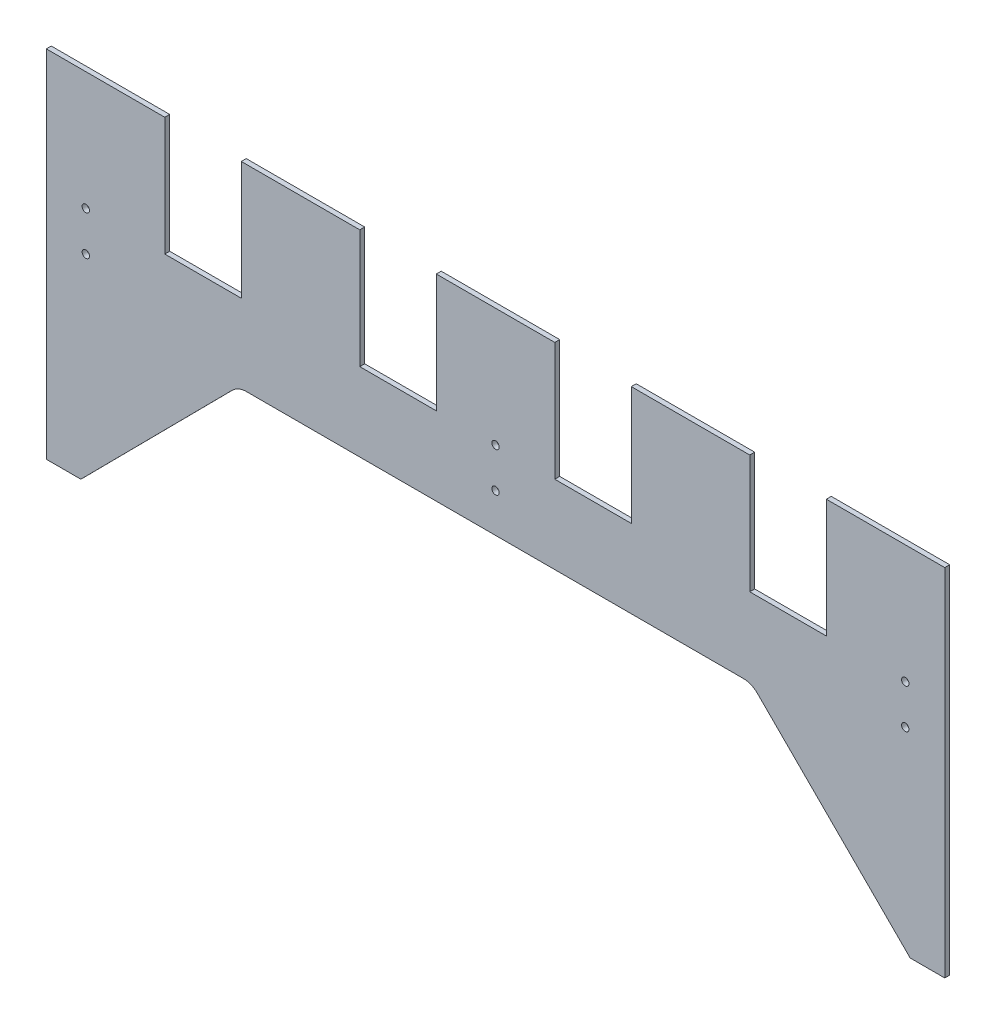
ISO-10303-21;
HEADER;
FILE_DESCRIPTION(('STEP AP214'),'2;1');
FILE_NAME('part.step','',(''),(''),'','','');
FILE_SCHEMA(('AUTOMOTIVE_DESIGN { 1 0 10303 214 1 1 1 1 }'));
ENDSEC;
DATA;
#1=APPLICATION_CONTEXT('core data for automotive mechanical design processes');
#2=APPLICATION_PROTOCOL_DEFINITION('international standard','automotive_design',2000,#1);
#3=PRODUCT_CONTEXT('',#1,'mechanical');
#4=PRODUCT('Part','Part','',(#3));
#5=PRODUCT_RELATED_PRODUCT_CATEGORY('part','',(#4));
#6=PRODUCT_DEFINITION_FORMATION('','',#4);
#7=PRODUCT_DEFINITION_CONTEXT('part definition',#1,'design');
#8=PRODUCT_DEFINITION('design','',#6,#7);
#9=PRODUCT_DEFINITION_SHAPE('','',#8);
#10=(LENGTH_UNIT() NAMED_UNIT(*) SI_UNIT(.MILLI.,.METRE.));
#11=(NAMED_UNIT(*) PLANE_ANGLE_UNIT() SI_UNIT($,.RADIAN.));
#12=(NAMED_UNIT(*) SI_UNIT($,.STERADIAN.) SOLID_ANGLE_UNIT());
#13=UNCERTAINTY_MEASURE_WITH_UNIT(LENGTH_MEASURE(1.E-05),#10,'distance_accuracy_value','');
#14=(GEOMETRIC_REPRESENTATION_CONTEXT(3) GLOBAL_UNCERTAINTY_ASSIGNED_CONTEXT((#13)) GLOBAL_UNIT_ASSIGNED_CONTEXT((#10,
#11,#12)) REPRESENTATION_CONTEXT('',''));
#15=CARTESIAN_POINT('',(0.,0.,0.));
#16=DIRECTION('',(0.,0.,1.));
#17=DIRECTION('',(1.,0.,0.));
#18=AXIS2_PLACEMENT_3D('',#15,#16,#17);
#19=CARTESIAN_POINT('',(0.,0.,0.));
#20=DIRECTION('',(0.,0.,1.));
#21=DIRECTION('',(1.,0.,0.));
#22=AXIS2_PLACEMENT_3D('',#19,#20,#21);
#23=PLANE('',#22);
#24=CARTESIAN_POINT('',(0.,25.4,0.));
#25=DIRECTION('',(0.,0.,-1.));
#26=DIRECTION('',(-1.,0.,0.));
#27=AXIS2_PLACEMENT_3D('',#24,#25,#26);
#28=CIRCLE('',#27,4.7625);
#29=CARTESIAN_POINT('',(-4.7625,25.4,0.));
#30=VERTEX_POINT('',#29);
#31=EDGE_CURVE('E212',#30,#30,#28,.F.);
#32=ORIENTED_EDGE('',*,*,#31,.T.);
#33=EDGE_LOOP('',(#32));
#34=FACE_BOUND('',#33,.T.);
#35=CARTESIAN_POINT('',(0.,76.2,0.));
#36=DIRECTION('',(0.,0.,-1.));
#37=DIRECTION('',(-1.,0.,0.));
#38=AXIS2_PLACEMENT_3D('',#35,#36,#37);
#39=CIRCLE('',#38,4.7625);
#40=CARTESIAN_POINT('',(-4.7625,76.2,0.));
#41=VERTEX_POINT('',#40);
#42=EDGE_CURVE('E551',#41,#41,#39,.F.);
#43=ORIENTED_EDGE('',*,*,#42,.T.);
#44=EDGE_LOOP('',(#43));
#45=FACE_BOUND('',#44,.T.);
#46=CARTESIAN_POINT('',(-527.05,76.2,0.));
#47=DIRECTION('',(0.,0.,1.));
#48=DIRECTION('',(1.,0.,0.));
#49=AXIS2_PLACEMENT_3D('',#46,#47,#48);
#50=CIRCLE('',#49,4.7625);
#51=CARTESIAN_POINT('',(-522.2875,76.2,0.));
#52=VERTEX_POINT('',#51);
#53=EDGE_CURVE('E554',#52,#52,#50,.T.);
#54=ORIENTED_EDGE('',*,*,#53,.T.);
#55=EDGE_LOOP('',(#54));
#56=FACE_BOUND('',#55,.T.);
#57=CARTESIAN_POINT('',(-527.05,25.4,0.));
#58=DIRECTION('',(0.,0.,1.));
#59=DIRECTION('',(1.,0.,0.));
#60=AXIS2_PLACEMENT_3D('',#57,#58,#59);
#61=CIRCLE('',#60,4.7625);
#62=CARTESIAN_POINT('',(-522.2875,25.4,0.));
#63=VERTEX_POINT('',#62);
#64=EDGE_CURVE('E557',#63,#63,#61,.T.);
#65=ORIENTED_EDGE('',*,*,#64,.T.);
#66=EDGE_LOOP('',(#65));
#67=FACE_BOUND('',#66,.T.);
#68=CARTESIAN_POINT('',(527.05,76.2,0.));
#69=DIRECTION('',(0.,0.,-1.));
#70=DIRECTION('',(-1.,0.,0.));
#71=AXIS2_PLACEMENT_3D('',#68,#69,#70);
#72=CIRCLE('',#71,4.7625);
#73=CARTESIAN_POINT('',(522.2875,76.2,0.));
#74=VERTEX_POINT('',#73);
#75=EDGE_CURVE('E560',#74,#74,#72,.F.);
#76=ORIENTED_EDGE('',*,*,#75,.T.);
#77=EDGE_LOOP('',(#76));
#78=FACE_BOUND('',#77,.T.);
#79=CARTESIAN_POINT('',(527.05,25.4,0.));
#80=DIRECTION('',(0.,0.,-1.));
#81=DIRECTION('',(-1.,0.,0.));
#82=AXIS2_PLACEMENT_3D('',#79,#80,#81);
#83=CIRCLE('',#82,4.7625);
#84=CARTESIAN_POINT('',(522.2875,25.4,0.));
#85=VERTEX_POINT('',#84);
#86=EDGE_CURVE('E463',#85,#85,#83,.F.);
#87=ORIENTED_EDGE('',*,*,#86,.T.);
#88=EDGE_LOOP('',(#87));
#89=FACE_BOUND('',#88,.T.);
#90=DIRECTION('',(-0.703965142447958,-0.710234523392257,0.));
#91=VECTOR('',#90,1.);
#92=CARTESIAN_POINT('',(-331.100819197342,-24.4991808026428,0.));
#93=LINE('',#92,#91);
#94=CARTESIAN_POINT('',(-338.553730356378,-32.0184661844913,0.));
#95=VERTEX_POINT('',#94);
#96=CARTESIAN_POINT('',(-533.399999999995,-228.600000000003,0.));
#97=VERTEX_POINT('',#96);
#98=EDGE_CURVE('E64',#95,#97,#93,.T.);
#99=ORIENTED_EDGE('',*,*,#98,.T.);
#100=DIRECTION('',(1.,0.,0.));
#101=VECTOR('',#100,1.);
#102=CARTESIAN_POINT('',(-577.85,-228.6,0.));
#103=LINE('',#102,#101);
#104=CARTESIAN_POINT('',(-577.85,-228.6,0.));
#105=VERTEX_POINT('',#104);
#106=EDGE_CURVE('E267',#105,#97,#103,.T.);
#107=ORIENTED_EDGE('',*,*,#106,.F.);
#108=DIRECTION('',(0.,1.,0.));
#109=VECTOR('',#108,1.);
#110=CARTESIAN_POINT('',(-577.85,228.6,0.));
#111=LINE('',#110,#109);
#112=CARTESIAN_POINT('',(-577.85,228.6,0.));
#113=VERTEX_POINT('',#112);
#114=EDGE_CURVE('E268',#113,#105,#111,.F.);
#115=ORIENTED_EDGE('',*,*,#114,.F.);
#116=DIRECTION('',(1.,0.,0.));
#117=VECTOR('',#116,1.);
#118=CARTESIAN_POINT('',(577.85,228.6,0.));
#119=LINE('',#118,#117);
#120=CARTESIAN_POINT('',(-425.45,228.6,0.));
#121=VERTEX_POINT('',#120);
#122=EDGE_CURVE('E289',#121,#113,#119,.F.);
#123=ORIENTED_EDGE('',*,*,#122,.F.);
#124=DIRECTION('',(0.,1.,0.));
#125=VECTOR('',#124,1.);
#126=CARTESIAN_POINT('',(-425.45,228.6,0.));
#127=LINE('',#126,#125);
#128=CARTESIAN_POINT('',(-425.45,76.2,0.));
#129=VERTEX_POINT('',#128);
#130=EDGE_CURVE('E299',#121,#129,#127,.F.);
#131=ORIENTED_EDGE('',*,*,#130,.T.);
#132=DIRECTION('',(1.,0.,0.));
#133=VECTOR('',#132,1.);
#134=CARTESIAN_POINT('',(-425.45,76.2,0.));
#135=LINE('',#134,#133);
#136=CARTESIAN_POINT('',(-327.025,76.2,0.));
#137=VERTEX_POINT('',#136);
#138=EDGE_CURVE('E309',#129,#137,#135,.T.);
#139=ORIENTED_EDGE('',*,*,#138,.T.);
#140=DIRECTION('',(0.,1.,0.));
#141=VECTOR('',#140,1.);
#142=CARTESIAN_POINT('',(-327.025,76.2,0.));
#143=LINE('',#142,#141);
#144=CARTESIAN_POINT('',(-327.025,228.6,0.));
#145=VERTEX_POINT('',#144);
#146=EDGE_CURVE('E319',#137,#145,#143,.T.);
#147=ORIENTED_EDGE('',*,*,#146,.T.);
#148=DIRECTION('',(1.,0.,0.));
#149=VECTOR('',#148,1.);
#150=CARTESIAN_POINT('',(577.85,228.6,0.));
#151=LINE('',#150,#149);
#152=CARTESIAN_POINT('',(-174.625,228.6,0.));
#153=VERTEX_POINT('',#152);
#154=EDGE_CURVE('E330',#153,#145,#151,.F.);
#155=ORIENTED_EDGE('',*,*,#154,.F.);
#156=DIRECTION('',(0.,1.,0.));
#157=VECTOR('',#156,1.);
#158=CARTESIAN_POINT('',(-174.625,228.6,0.));
#159=LINE('',#158,#157);
#160=CARTESIAN_POINT('',(-174.625,76.2,0.));
#161=VERTEX_POINT('',#160);
#162=EDGE_CURVE('E340',#153,#161,#159,.F.);
#163=ORIENTED_EDGE('',*,*,#162,.T.);
#164=DIRECTION('',(1.,0.,0.));
#165=VECTOR('',#164,1.);
#166=CARTESIAN_POINT('',(-174.625,76.2,0.));
#167=LINE('',#166,#165);
#168=CARTESIAN_POINT('',(-76.2,76.2,0.));
#169=VERTEX_POINT('',#168);
#170=EDGE_CURVE('E350',#161,#169,#167,.T.);
#171=ORIENTED_EDGE('',*,*,#170,.T.);
#172=DIRECTION('',(0.,1.,0.));
#173=VECTOR('',#172,1.);
#174=CARTESIAN_POINT('',(-76.2,76.2,0.));
#175=LINE('',#174,#173);
#176=CARTESIAN_POINT('',(-76.2,228.6,0.));
#177=VERTEX_POINT('',#176);
#178=EDGE_CURVE('E360',#169,#177,#175,.T.);
#179=ORIENTED_EDGE('',*,*,#178,.T.);
#180=DIRECTION('',(1.,0.,0.));
#181=VECTOR('',#180,1.);
#182=CARTESIAN_POINT('',(577.85,228.6,0.));
#183=LINE('',#182,#181);
#184=CARTESIAN_POINT('',(76.2,228.6,0.));
#185=VERTEX_POINT('',#184);
#186=EDGE_CURVE('E371',#185,#177,#183,.F.);
#187=ORIENTED_EDGE('',*,*,#186,.F.);
#188=DIRECTION('',(0.,1.,0.));
#189=VECTOR('',#188,1.);
#190=CARTESIAN_POINT('',(76.2,228.6,0.));
#191=LINE('',#190,#189);
#192=CARTESIAN_POINT('',(76.2,76.2,0.));
#193=VERTEX_POINT('',#192);
#194=EDGE_CURVE('E381',#185,#193,#191,.F.);
#195=ORIENTED_EDGE('',*,*,#194,.T.);
#196=DIRECTION('',(1.,0.,0.));
#197=VECTOR('',#196,1.);
#198=CARTESIAN_POINT('',(76.2,76.2,0.));
#199=LINE('',#198,#197);
#200=CARTESIAN_POINT('',(174.625,76.2,0.));
#201=VERTEX_POINT('',#200);
#202=EDGE_CURVE('E391',#193,#201,#199,.T.);
#203=ORIENTED_EDGE('',*,*,#202,.T.);
#204=DIRECTION('',(0.,1.,0.));
#205=VECTOR('',#204,1.);
#206=CARTESIAN_POINT('',(174.625,76.2,0.));
#207=LINE('',#206,#205);
#208=CARTESIAN_POINT('',(174.625,228.6,0.));
#209=VERTEX_POINT('',#208);
#210=EDGE_CURVE('E401',#201,#209,#207,.T.);
#211=ORIENTED_EDGE('',*,*,#210,.T.);
#212=DIRECTION('',(1.,0.,0.));
#213=VECTOR('',#212,1.);
#214=CARTESIAN_POINT('',(577.85,228.6,0.));
#215=LINE('',#214,#213);
#216=CARTESIAN_POINT('',(327.025,228.6,0.));
#217=VERTEX_POINT('',#216);
#218=EDGE_CURVE('E412',#217,#209,#215,.F.);
#219=ORIENTED_EDGE('',*,*,#218,.F.);
#220=DIRECTION('',(0.,1.,0.));
#221=VECTOR('',#220,1.);
#222=CARTESIAN_POINT('',(327.025,228.6,0.));
#223=LINE('',#222,#221);
#224=CARTESIAN_POINT('',(327.025,76.2,0.));
#225=VERTEX_POINT('',#224);
#226=EDGE_CURVE('E422',#217,#225,#223,.F.);
#227=ORIENTED_EDGE('',*,*,#226,.T.);
#228=DIRECTION('',(1.,0.,0.));
#229=VECTOR('',#228,1.);
#230=CARTESIAN_POINT('',(327.025,76.2,0.));
#231=LINE('',#230,#229);
#232=CARTESIAN_POINT('',(425.45,76.2,0.));
#233=VERTEX_POINT('',#232);
#234=EDGE_CURVE('E432',#225,#233,#231,.T.);
#235=ORIENTED_EDGE('',*,*,#234,.T.);
#236=DIRECTION('',(0.,1.,0.));
#237=VECTOR('',#236,1.);
#238=CARTESIAN_POINT('',(425.45,76.2,0.));
#239=LINE('',#238,#237);
#240=CARTESIAN_POINT('',(425.45,228.6,0.));
#241=VERTEX_POINT('',#240);
#242=EDGE_CURVE('E442',#233,#241,#239,.T.);
#243=ORIENTED_EDGE('',*,*,#242,.T.);
#244=DIRECTION('',(1.,0.,0.));
#245=VECTOR('',#244,1.);
#246=CARTESIAN_POINT('',(577.85,228.6,0.));
#247=LINE('',#246,#245);
#248=CARTESIAN_POINT('',(577.85,228.6,0.));
#249=VERTEX_POINT('',#248);
#250=EDGE_CURVE('E452',#249,#241,#247,.F.);
#251=ORIENTED_EDGE('',*,*,#250,.F.);
#252=DIRECTION('',(0.,1.,0.));
#253=VECTOR('',#252,1.);
#254=CARTESIAN_POINT('',(577.85,-228.6,0.));
#255=LINE('',#254,#253);
#256=CARTESIAN_POINT('',(577.85,-228.6,0.));
#257=VERTEX_POINT('',#256);
#258=EDGE_CURVE('E453',#257,#249,#255,.T.);
#259=ORIENTED_EDGE('',*,*,#258,.F.);
#260=DIRECTION('',(1.,0.,0.));
#261=VECTOR('',#260,1.);
#262=CARTESIAN_POINT('',(-577.85,-228.6,0.));
#263=LINE('',#262,#261);
#264=CARTESIAN_POINT('',(533.4,-228.6,0.));
#265=VERTEX_POINT('',#264);
#266=EDGE_CURVE('E195',#265,#257,#263,.T.);
#267=ORIENTED_EDGE('',*,*,#266,.F.);
#268=DIRECTION('',(-0.707106781186548,0.707106781186548,0.));
#269=VECTOR('',#268,1.);
#270=CARTESIAN_POINT('',(533.4,-228.6,0.));
#271=LINE('',#270,#269);
#272=CARTESIAN_POINT('',(336.738668560508,-31.9386685605082,0.));
#273=VERTEX_POINT('',#272);
#274=EDGE_CURVE('E218',#265,#273,#271,.T.);
#275=ORIENTED_EDGE('',*,*,#274,.T.);
#276=CARTESIAN_POINT('',(318.77815631846,-49.8991808026326,0.));
#277=DIRECTION('',(0.,0.,-1.));
#278=DIRECTION('',(-1.,0.,0.));
#279=AXIS2_PLACEMENT_3D('',#276,#277,#278);
#280=CIRCLE('',#279,25.4);
#281=CARTESIAN_POINT('',(318.77815631846,-24.4991808026377,0.));
#282=VERTEX_POINT('',#281);
#283=EDGE_CURVE('E241',#273,#282,#280,.F.);
#284=ORIENTED_EDGE('',*,*,#283,.T.);
#285=DIRECTION('',(1.,0.,0.));
#286=VECTOR('',#285,1.);
#287=CARTESIAN_POINT('',(329.299180802658,-24.4991808026428,0.));
#288=LINE('',#287,#286);
#289=CARTESIAN_POINT('',(-320.513773462154,-24.4991808026428,0.));
#290=VERTEX_POINT('',#289);
#291=EDGE_CURVE('E249',#282,#290,#288,.F.);
#292=ORIENTED_EDGE('',*,*,#291,.T.);
#293=CARTESIAN_POINT('',(-320.513773462154,-49.8991808026326,0.));
#294=DIRECTION('',(0.,0.,-1.));
#295=DIRECTION('',(-1.,0.,0.));
#296=AXIS2_PLACEMENT_3D('',#293,#294,#295);
#297=CIRCLE('',#296,25.4);
#298=EDGE_CURVE('E20',#290,#95,#297,.F.);
#299=ORIENTED_EDGE('',*,*,#298,.T.);
#300=EDGE_LOOP('',(#99,#107,#115,#123,#131,#139,#147,#155,#163,#171,#179,#187,#195,#203,#211,
#219,#227,#235,#243,#251,#259,#267,#275,#284,#292,#299));
#301=FACE_BOUND('',#300,.T.);
#302=ADVANCED_FACE('F17',(#34,#45,#56,#67,#78,#89,#301),#23,.F.);
#303=CARTESIAN_POINT('',(-577.85,-228.6,0.));
#304=DIRECTION('',(0.,-1.,0.));
#305=DIRECTION('',(0.,0.,-1.));
#306=AXIS2_PLACEMENT_3D('',#303,#304,#305);
#307=PLANE('',#306);
#308=DIRECTION('',(1.,0.,0.));
#309=VECTOR('',#308,1.);
#310=CARTESIAN_POINT('',(0.,-228.6,6.35));
#311=LINE('',#310,#309);
#312=CARTESIAN_POINT('',(533.4,-228.6,6.35));
#313=VERTEX_POINT('',#312);
#314=CARTESIAN_POINT('',(577.85,-228.6,6.35));
#315=VERTEX_POINT('',#314);
#316=EDGE_CURVE('E200',#313,#315,#311,.T.);
#317=ORIENTED_EDGE('',*,*,#316,.F.);
#318=DIRECTION('',(0.,0.,1.));
#319=VECTOR('',#318,1.);
#320=CARTESIAN_POINT('',(533.4,-228.6,6.35));
#321=LINE('',#320,#319);
#322=EDGE_CURVE('E203',#313,#265,#321,.F.);
#323=ORIENTED_EDGE('',*,*,#322,.T.);
#324=ORIENTED_EDGE('',*,*,#266,.T.);
#325=DIRECTION('',(0.,0.,-1.));
#326=VECTOR('',#325,1.);
#327=CARTESIAN_POINT('',(577.85,-228.6,0.));
#328=LINE('',#327,#326);
#329=EDGE_CURVE('E206',#315,#257,#328,.T.);
#330=ORIENTED_EDGE('',*,*,#329,.F.);
#331=EDGE_LOOP('',(#317,#323,#324,#330));
#332=FACE_BOUND('',#331,.T.);
#333=ADVANCED_FACE('F202',(#332),#307,.T.);
#334=CARTESIAN_POINT('',(577.85,-228.6,0.));
#335=DIRECTION('',(1.,0.,0.));
#336=DIRECTION('',(0.,0.,-1.));
#337=AXIS2_PLACEMENT_3D('',#334,#335,#336);
#338=PLANE('',#337);
#339=ORIENTED_EDGE('',*,*,#329,.T.);
#340=ORIENTED_EDGE('',*,*,#258,.T.);
#341=DIRECTION('',(0.,0.,1.));
#342=VECTOR('',#341,1.);
#343=CARTESIAN_POINT('',(577.85,228.6,0.));
#344=LINE('',#343,#342);
#345=CARTESIAN_POINT('',(577.85,228.6,6.35));
#346=VERTEX_POINT('',#345);
#347=EDGE_CURVE('E449',#346,#249,#344,.F.);
#348=ORIENTED_EDGE('',*,*,#347,.F.);
#349=DIRECTION('',(0.,1.,0.));
#350=VECTOR('',#349,1.);
#351=CARTESIAN_POINT('',(577.85,0.,6.35));
#352=LINE('',#351,#350);
#353=EDGE_CURVE('E211',#315,#346,#352,.T.);
#354=ORIENTED_EDGE('',*,*,#353,.F.);
#355=EDGE_LOOP('',(#339,#340,#348,#354));
#356=FACE_BOUND('',#355,.T.);
#357=ADVANCED_FACE('F659',(#356),#338,.T.);
#358=CARTESIAN_POINT('',(577.85,228.6,0.));
#359=DIRECTION('',(0.,1.,0.));
#360=DIRECTION('',(0.,0.,1.));
#361=AXIS2_PLACEMENT_3D('',#358,#359,#360);
#362=PLANE('',#361);
#363=ORIENTED_EDGE('',*,*,#250,.T.);
#364=DIRECTION('',(0.,0.,-1.));
#365=VECTOR('',#364,1.);
#366=CARTESIAN_POINT('',(425.45,228.6,6.35));
#367=LINE('',#366,#365);
#368=CARTESIAN_POINT('',(425.45,228.6,6.35));
#369=VERTEX_POINT('',#368);
#370=EDGE_CURVE('E440',#241,#369,#367,.F.);
#371=ORIENTED_EDGE('',*,*,#370,.T.);
#372=DIRECTION('',(1.,0.,0.));
#373=VECTOR('',#372,1.);
#374=CARTESIAN_POINT('',(0.,228.6,6.35));
#375=LINE('',#374,#373);
#376=EDGE_CURVE('E437',#346,#369,#375,.F.);
#377=ORIENTED_EDGE('',*,*,#376,.F.);
#378=ORIENTED_EDGE('',*,*,#347,.T.);
#379=EDGE_LOOP('',(#363,#371,#377,#378));
#380=FACE_BOUND('',#379,.T.);
#381=ADVANCED_FACE('F656',(#380),#362,.T.);
#382=CARTESIAN_POINT('',(425.45,76.2,6.35));
#383=DIRECTION('',(1.,0.,0.));
#384=DIRECTION('',(0.,0.,-1.));
#385=AXIS2_PLACEMENT_3D('',#382,#383,#384);
#386=PLANE('',#385);
#387=DIRECTION('',(0.,1.,0.));
#388=VECTOR('',#387,1.);
#389=CARTESIAN_POINT('',(425.45,0.,6.35));
#390=LINE('',#389,#388);
#391=CARTESIAN_POINT('',(425.45,76.2,6.35));
#392=VERTEX_POINT('',#391);
#393=EDGE_CURVE('E427',#369,#392,#390,.F.);
#394=ORIENTED_EDGE('',*,*,#393,.F.);
#395=ORIENTED_EDGE('',*,*,#370,.F.);
#396=ORIENTED_EDGE('',*,*,#242,.F.);
#397=DIRECTION('',(0.,0.,-1.));
#398=VECTOR('',#397,1.);
#399=CARTESIAN_POINT('',(425.45,76.2,6.35));
#400=LINE('',#399,#398);
#401=EDGE_CURVE('E430',#233,#392,#400,.F.);
#402=ORIENTED_EDGE('',*,*,#401,.T.);
#403=EDGE_LOOP('',(#394,#395,#396,#402));
#404=FACE_BOUND('',#403,.T.);
#405=ADVANCED_FACE('F652',(#404),#386,.F.);
#406=CARTESIAN_POINT('',(327.025,76.2,6.35));
#407=DIRECTION('',(0.,-1.,0.));
#408=DIRECTION('',(0.,0.,-1.));
#409=AXIS2_PLACEMENT_3D('',#406,#407,#408);
#410=PLANE('',#409);
#411=DIRECTION('',(1.,0.,0.));
#412=VECTOR('',#411,1.);
#413=CARTESIAN_POINT('',(0.,76.2,6.35));
#414=LINE('',#413,#412);
#415=CARTESIAN_POINT('',(327.025,76.2,6.35));
#416=VERTEX_POINT('',#415);
#417=EDGE_CURVE('E417',#392,#416,#414,.F.);
#418=ORIENTED_EDGE('',*,*,#417,.F.);
#419=ORIENTED_EDGE('',*,*,#401,.F.);
#420=ORIENTED_EDGE('',*,*,#234,.F.);
#421=DIRECTION('',(0.,0.,1.));
#422=VECTOR('',#421,1.);
#423=CARTESIAN_POINT('',(327.025,76.2,6.35));
#424=LINE('',#423,#422);
#425=EDGE_CURVE('E420',#225,#416,#424,.T.);
#426=ORIENTED_EDGE('',*,*,#425,.T.);
#427=EDGE_LOOP('',(#418,#419,#420,#426));
#428=FACE_BOUND('',#427,.T.);
#429=ADVANCED_FACE('F649',(#428),#410,.F.);
#430=CARTESIAN_POINT('',(327.025,228.6,6.35));
#431=DIRECTION('',(-1.,0.,0.));
#432=DIRECTION('',(0.,0.,1.));
#433=AXIS2_PLACEMENT_3D('',#430,#431,#432);
#434=PLANE('',#433);
#435=DIRECTION('',(0.,1.,0.));
#436=VECTOR('',#435,1.);
#437=CARTESIAN_POINT('',(327.025,0.,6.35));
#438=LINE('',#437,#436);
#439=CARTESIAN_POINT('',(327.025,228.6,6.35));
#440=VERTEX_POINT('',#439);
#441=EDGE_CURVE('E406',#416,#440,#438,.T.);
#442=ORIENTED_EDGE('',*,*,#441,.F.);
#443=ORIENTED_EDGE('',*,*,#425,.F.);
#444=ORIENTED_EDGE('',*,*,#226,.F.);
#445=DIRECTION('',(0.,0.,1.));
#446=VECTOR('',#445,1.);
#447=CARTESIAN_POINT('',(327.025,228.6,0.));
#448=LINE('',#447,#446);
#449=EDGE_CURVE('E409',#440,#217,#448,.F.);
#450=ORIENTED_EDGE('',*,*,#449,.F.);
#451=EDGE_LOOP('',(#442,#443,#444,#450));
#452=FACE_BOUND('',#451,.T.);
#453=ADVANCED_FACE('F642',(#452),#434,.F.);
#454=CARTESIAN_POINT('',(577.85,228.6,0.));
#455=DIRECTION('',(0.,1.,0.));
#456=DIRECTION('',(0.,0.,1.));
#457=AXIS2_PLACEMENT_3D('',#454,#455,#456);
#458=PLANE('',#457);
#459=DIRECTION('',(1.,0.,0.));
#460=VECTOR('',#459,1.);
#461=CARTESIAN_POINT('',(0.,228.6,6.35));
#462=LINE('',#461,#460);
#463=CARTESIAN_POINT('',(174.625,228.6,6.35));
#464=VERTEX_POINT('',#463);
#465=EDGE_CURVE('E396',#440,#464,#462,.F.);
#466=ORIENTED_EDGE('',*,*,#465,.F.);
#467=ORIENTED_EDGE('',*,*,#449,.T.);
#468=ORIENTED_EDGE('',*,*,#218,.T.);
#469=DIRECTION('',(0.,0.,-1.));
#470=VECTOR('',#469,1.);
#471=CARTESIAN_POINT('',(174.625,228.6,6.35));
#472=LINE('',#471,#470);
#473=EDGE_CURVE('E399',#209,#464,#472,.F.);
#474=ORIENTED_EDGE('',*,*,#473,.T.);
#475=EDGE_LOOP('',(#466,#467,#468,#474));
#476=FACE_BOUND('',#475,.T.);
#477=ADVANCED_FACE('F639',(#476),#458,.T.);
#478=CARTESIAN_POINT('',(174.625,76.2,6.35));
#479=DIRECTION('',(1.,0.,0.));
#480=DIRECTION('',(0.,0.,-1.));
#481=AXIS2_PLACEMENT_3D('',#478,#479,#480);
#482=PLANE('',#481);
#483=DIRECTION('',(0.,1.,0.));
#484=VECTOR('',#483,1.);
#485=CARTESIAN_POINT('',(174.625,0.,6.35));
#486=LINE('',#485,#484);
#487=CARTESIAN_POINT('',(174.625,76.2,6.35));
#488=VERTEX_POINT('',#487);
#489=EDGE_CURVE('E386',#464,#488,#486,.F.);
#490=ORIENTED_EDGE('',*,*,#489,.F.);
#491=ORIENTED_EDGE('',*,*,#473,.F.);
#492=ORIENTED_EDGE('',*,*,#210,.F.);
#493=DIRECTION('',(0.,0.,-1.));
#494=VECTOR('',#493,1.);
#495=CARTESIAN_POINT('',(174.625,76.2,6.35));
#496=LINE('',#495,#494);
#497=EDGE_CURVE('E389',#201,#488,#496,.F.);
#498=ORIENTED_EDGE('',*,*,#497,.T.);
#499=EDGE_LOOP('',(#490,#491,#492,#498));
#500=FACE_BOUND('',#499,.T.);
#501=ADVANCED_FACE('F634',(#500),#482,.F.);
#502=CARTESIAN_POINT('',(76.2,76.2,6.35));
#503=DIRECTION('',(0.,-1.,0.));
#504=DIRECTION('',(0.,0.,-1.));
#505=AXIS2_PLACEMENT_3D('',#502,#503,#504);
#506=PLANE('',#505);
#507=DIRECTION('',(1.,0.,0.));
#508=VECTOR('',#507,1.);
#509=CARTESIAN_POINT('',(0.,76.2,6.35));
#510=LINE('',#509,#508);
#511=CARTESIAN_POINT('',(76.2,76.2,6.35));
#512=VERTEX_POINT('',#511);
#513=EDGE_CURVE('E377',#488,#512,#510,.F.);
#514=ORIENTED_EDGE('',*,*,#513,.F.);
#515=ORIENTED_EDGE('',*,*,#497,.F.);
#516=ORIENTED_EDGE('',*,*,#202,.F.);
#517=DIRECTION('',(0.,0.,1.));
#518=VECTOR('',#517,1.);
#519=CARTESIAN_POINT('',(76.2,76.2,6.35));
#520=LINE('',#519,#518);
#521=EDGE_CURVE('E372',#193,#512,#520,.T.);
#522=ORIENTED_EDGE('',*,*,#521,.T.);
#523=EDGE_LOOP('',(#514,#515,#516,#522));
#524=FACE_BOUND('',#523,.T.);
#525=ADVANCED_FACE('F631',(#524),#506,.F.);
#526=CARTESIAN_POINT('',(76.2,228.6,6.35));
#527=DIRECTION('',(-1.,0.,0.));
#528=DIRECTION('',(0.,0.,1.));
#529=AXIS2_PLACEMENT_3D('',#526,#527,#528);
#530=PLANE('',#529);
#531=DIRECTION('',(0.,1.,0.));
#532=VECTOR('',#531,1.);
#533=CARTESIAN_POINT('',(76.2,0.,6.35));
#534=LINE('',#533,#532);
#535=CARTESIAN_POINT('',(76.2,228.6,6.35));
#536=VERTEX_POINT('',#535);
#537=EDGE_CURVE('E365',#512,#536,#534,.T.);
#538=ORIENTED_EDGE('',*,*,#537,.F.);
#539=ORIENTED_EDGE('',*,*,#521,.F.);
#540=ORIENTED_EDGE('',*,*,#194,.F.);
#541=DIRECTION('',(0.,0.,1.));
#542=VECTOR('',#541,1.);
#543=CARTESIAN_POINT('',(76.2,228.6,0.));
#544=LINE('',#543,#542);
#545=EDGE_CURVE('E368',#536,#185,#544,.F.);
#546=ORIENTED_EDGE('',*,*,#545,.F.);
#547=EDGE_LOOP('',(#538,#539,#540,#546));
#548=FACE_BOUND('',#547,.T.);
#549=ADVANCED_FACE('F624',(#548),#530,.F.);
#550=CARTESIAN_POINT('',(577.85,228.6,0.));
#551=DIRECTION('',(0.,1.,0.));
#552=DIRECTION('',(0.,0.,1.));
#553=AXIS2_PLACEMENT_3D('',#550,#551,#552);
#554=PLANE('',#553);
#555=ORIENTED_EDGE('',*,*,#545,.T.);
#556=ORIENTED_EDGE('',*,*,#186,.T.);
#557=DIRECTION('',(0.,0.,-1.));
#558=VECTOR('',#557,1.);
#559=CARTESIAN_POINT('',(-76.2,228.6,6.35));
#560=LINE('',#559,#558);
#561=CARTESIAN_POINT('',(-76.2,228.6,6.35));
#562=VERTEX_POINT('',#561);
#563=EDGE_CURVE('E358',#177,#562,#560,.F.);
#564=ORIENTED_EDGE('',*,*,#563,.T.);
#565=DIRECTION('',(1.,0.,0.));
#566=VECTOR('',#565,1.);
#567=CARTESIAN_POINT('',(0.,228.6,6.35));
#568=LINE('',#567,#566);
#569=EDGE_CURVE('E355',#536,#562,#568,.F.);
#570=ORIENTED_EDGE('',*,*,#569,.F.);
#571=EDGE_LOOP('',(#555,#556,#564,#570));
#572=FACE_BOUND('',#571,.T.);
#573=ADVANCED_FACE('F620',(#572),#554,.T.);
#574=CARTESIAN_POINT('',(-76.2,76.2,6.35));
#575=DIRECTION('',(1.,0.,0.));
#576=DIRECTION('',(0.,0.,-1.));
#577=AXIS2_PLACEMENT_3D('',#574,#575,#576);
#578=PLANE('',#577);
#579=DIRECTION('',(0.,1.,0.));
#580=VECTOR('',#579,1.);
#581=CARTESIAN_POINT('',(-76.2,0.,6.35));
#582=LINE('',#581,#580);
#583=CARTESIAN_POINT('',(-76.2,76.2,6.35));
#584=VERTEX_POINT('',#583);
#585=EDGE_CURVE('E345',#562,#584,#582,.F.);
#586=ORIENTED_EDGE('',*,*,#585,.F.);
#587=ORIENTED_EDGE('',*,*,#563,.F.);
#588=ORIENTED_EDGE('',*,*,#178,.F.);
#589=DIRECTION('',(0.,0.,-1.));
#590=VECTOR('',#589,1.);
#591=CARTESIAN_POINT('',(-76.2,76.2,6.35));
#592=LINE('',#591,#590);
#593=EDGE_CURVE('E348',#169,#584,#592,.F.);
#594=ORIENTED_EDGE('',*,*,#593,.T.);
#595=EDGE_LOOP('',(#586,#587,#588,#594));
#596=FACE_BOUND('',#595,.T.);
#597=ADVANCED_FACE('F616',(#596),#578,.F.);
#598=CARTESIAN_POINT('',(-174.625,76.2,6.35));
#599=DIRECTION('',(0.,-1.,0.));
#600=DIRECTION('',(0.,0.,-1.));
#601=AXIS2_PLACEMENT_3D('',#598,#599,#600);
#602=PLANE('',#601);
#603=DIRECTION('',(1.,0.,0.));
#604=VECTOR('',#603,1.);
#605=CARTESIAN_POINT('',(0.,76.2,6.35));
#606=LINE('',#605,#604);
#607=CARTESIAN_POINT('',(-174.625,76.2,6.35));
#608=VERTEX_POINT('',#607);
#609=EDGE_CURVE('E336',#584,#608,#606,.F.);
#610=ORIENTED_EDGE('',*,*,#609,.F.);
#611=ORIENTED_EDGE('',*,*,#593,.F.);
#612=ORIENTED_EDGE('',*,*,#170,.F.);
#613=DIRECTION('',(0.,0.,1.));
#614=VECTOR('',#613,1.);
#615=CARTESIAN_POINT('',(-174.625,76.2,6.35));
#616=LINE('',#615,#614);
#617=EDGE_CURVE('E331',#161,#608,#616,.T.);
#618=ORIENTED_EDGE('',*,*,#617,.T.);
#619=EDGE_LOOP('',(#610,#611,#612,#618));
#620=FACE_BOUND('',#619,.T.);
#621=ADVANCED_FACE('F613',(#620),#602,.F.);
#622=CARTESIAN_POINT('',(-174.625,228.6,6.35));
#623=DIRECTION('',(-1.,0.,0.));
#624=DIRECTION('',(0.,0.,1.));
#625=AXIS2_PLACEMENT_3D('',#622,#623,#624);
#626=PLANE('',#625);
#627=DIRECTION('',(0.,1.,0.));
#628=VECTOR('',#627,1.);
#629=CARTESIAN_POINT('',(-174.625,0.,6.35));
#630=LINE('',#629,#628);
#631=CARTESIAN_POINT('',(-174.625,228.6,6.35));
#632=VERTEX_POINT('',#631);
#633=EDGE_CURVE('E324',#608,#632,#630,.T.);
#634=ORIENTED_EDGE('',*,*,#633,.F.);
#635=ORIENTED_EDGE('',*,*,#617,.F.);
#636=ORIENTED_EDGE('',*,*,#162,.F.);
#637=DIRECTION('',(0.,0.,1.));
#638=VECTOR('',#637,1.);
#639=CARTESIAN_POINT('',(-174.625,228.6,0.));
#640=LINE('',#639,#638);
#641=EDGE_CURVE('E327',#632,#153,#640,.F.);
#642=ORIENTED_EDGE('',*,*,#641,.F.);
#643=EDGE_LOOP('',(#634,#635,#636,#642));
#644=FACE_BOUND('',#643,.T.);
#645=ADVANCED_FACE('F606',(#644),#626,.F.);
#646=CARTESIAN_POINT('',(577.85,228.6,0.));
#647=DIRECTION('',(0.,1.,0.));
#648=DIRECTION('',(0.,0.,1.));
#649=AXIS2_PLACEMENT_3D('',#646,#647,#648);
#650=PLANE('',#649);
#651=ORIENTED_EDGE('',*,*,#154,.T.);
#652=DIRECTION('',(0.,0.,-1.));
#653=VECTOR('',#652,1.);
#654=CARTESIAN_POINT('',(-327.025,228.6,6.35));
#655=LINE('',#654,#653);
#656=CARTESIAN_POINT('',(-327.025,228.6,6.35));
#657=VERTEX_POINT('',#656);
#658=EDGE_CURVE('E317',#145,#657,#655,.F.);
#659=ORIENTED_EDGE('',*,*,#658,.T.);
#660=DIRECTION('',(1.,0.,0.));
#661=VECTOR('',#660,1.);
#662=CARTESIAN_POINT('',(0.,228.6,6.35));
#663=LINE('',#662,#661);
#664=EDGE_CURVE('E314',#632,#657,#663,.F.);
#665=ORIENTED_EDGE('',*,*,#664,.F.);
#666=ORIENTED_EDGE('',*,*,#641,.T.);
#667=EDGE_LOOP('',(#651,#659,#665,#666));
#668=FACE_BOUND('',#667,.T.);
#669=ADVANCED_FACE('F602',(#668),#650,.T.);
#670=CARTESIAN_POINT('',(-327.025,76.2,6.35));
#671=DIRECTION('',(1.,0.,0.));
#672=DIRECTION('',(0.,0.,-1.));
#673=AXIS2_PLACEMENT_3D('',#670,#671,#672);
#674=PLANE('',#673);
#675=DIRECTION('',(0.,1.,0.));
#676=VECTOR('',#675,1.);
#677=CARTESIAN_POINT('',(-327.025,0.,6.35));
#678=LINE('',#677,#676);
#679=CARTESIAN_POINT('',(-327.025,76.2,6.35));
#680=VERTEX_POINT('',#679);
#681=EDGE_CURVE('E304',#657,#680,#678,.F.);
#682=ORIENTED_EDGE('',*,*,#681,.F.);
#683=ORIENTED_EDGE('',*,*,#658,.F.);
#684=ORIENTED_EDGE('',*,*,#146,.F.);
#685=DIRECTION('',(0.,0.,-1.));
#686=VECTOR('',#685,1.);
#687=CARTESIAN_POINT('',(-327.025,76.2,6.35));
#688=LINE('',#687,#686);
#689=EDGE_CURVE('E307',#137,#680,#688,.F.);
#690=ORIENTED_EDGE('',*,*,#689,.T.);
#691=EDGE_LOOP('',(#682,#683,#684,#690));
#692=FACE_BOUND('',#691,.T.);
#693=ADVANCED_FACE('F598',(#692),#674,.F.);
#694=CARTESIAN_POINT('',(-425.45,76.2,6.35));
#695=DIRECTION('',(0.,-1.,0.));
#696=DIRECTION('',(0.,0.,-1.));
#697=AXIS2_PLACEMENT_3D('',#694,#695,#696);
#698=PLANE('',#697);
#699=DIRECTION('',(1.,0.,0.));
#700=VECTOR('',#699,1.);
#701=CARTESIAN_POINT('',(0.,76.2,6.35));
#702=LINE('',#701,#700);
#703=CARTESIAN_POINT('',(-425.45,76.2,6.35));
#704=VERTEX_POINT('',#703);
#705=EDGE_CURVE('E294',#680,#704,#702,.F.);
#706=ORIENTED_EDGE('',*,*,#705,.F.);
#707=ORIENTED_EDGE('',*,*,#689,.F.);
#708=ORIENTED_EDGE('',*,*,#138,.F.);
#709=DIRECTION('',(0.,0.,1.));
#710=VECTOR('',#709,1.);
#711=CARTESIAN_POINT('',(-425.45,76.2,6.35));
#712=LINE('',#711,#710);
#713=EDGE_CURVE('E297',#129,#704,#712,.T.);
#714=ORIENTED_EDGE('',*,*,#713,.T.);
#715=EDGE_LOOP('',(#706,#707,#708,#714));
#716=FACE_BOUND('',#715,.T.);
#717=ADVANCED_FACE('F595',(#716),#698,.F.);
#718=CARTESIAN_POINT('',(-425.45,228.6,6.35));
#719=DIRECTION('',(-1.,0.,0.));
#720=DIRECTION('',(0.,0.,1.));
#721=AXIS2_PLACEMENT_3D('',#718,#719,#720);
#722=PLANE('',#721);
#723=DIRECTION('',(0.,1.,0.));
#724=VECTOR('',#723,1.);
#725=CARTESIAN_POINT('',(-425.45,0.,6.35));
#726=LINE('',#725,#724);
#727=CARTESIAN_POINT('',(-425.45,228.6,6.35));
#728=VERTEX_POINT('',#727);
#729=EDGE_CURVE('E284',#704,#728,#726,.T.);
#730=ORIENTED_EDGE('',*,*,#729,.F.);
#731=ORIENTED_EDGE('',*,*,#713,.F.);
#732=ORIENTED_EDGE('',*,*,#130,.F.);
#733=DIRECTION('',(0.,0.,1.));
#734=VECTOR('',#733,1.);
#735=CARTESIAN_POINT('',(-425.45,228.6,0.));
#736=LINE('',#735,#734);
#737=EDGE_CURVE('E279',#728,#121,#736,.F.);
#738=ORIENTED_EDGE('',*,*,#737,.F.);
#739=EDGE_LOOP('',(#730,#731,#732,#738));
#740=FACE_BOUND('',#739,.T.);
#741=ADVANCED_FACE('F588',(#740),#722,.F.);
#742=CARTESIAN_POINT('',(577.85,228.6,0.));
#743=DIRECTION('',(0.,1.,0.));
#744=DIRECTION('',(0.,0.,1.));
#745=AXIS2_PLACEMENT_3D('',#742,#743,#744);
#746=PLANE('',#745);
#747=DIRECTION('',(1.,0.,0.));
#748=VECTOR('',#747,1.);
#749=CARTESIAN_POINT('',(0.,228.6,6.35));
#750=LINE('',#749,#748);
#751=CARTESIAN_POINT('',(-577.85,228.6,6.35));
#752=VERTEX_POINT('',#751);
#753=EDGE_CURVE('E273',#728,#752,#750,.F.);
#754=ORIENTED_EDGE('',*,*,#753,.F.);
#755=ORIENTED_EDGE('',*,*,#737,.T.);
#756=ORIENTED_EDGE('',*,*,#122,.T.);
#757=DIRECTION('',(0.,0.,1.));
#758=VECTOR('',#757,1.);
#759=CARTESIAN_POINT('',(-577.85,228.6,0.));
#760=LINE('',#759,#758);
#761=EDGE_CURVE('E276',#752,#113,#760,.F.);
#762=ORIENTED_EDGE('',*,*,#761,.F.);
#763=EDGE_LOOP('',(#754,#755,#756,#762));
#764=FACE_BOUND('',#763,.T.);
#765=ADVANCED_FACE('F585',(#764),#746,.T.);
#766=CARTESIAN_POINT('',(-577.85,228.6,0.));
#767=DIRECTION('',(-1.,0.,0.));
#768=DIRECTION('',(0.,0.,1.));
#769=AXIS2_PLACEMENT_3D('',#766,#767,#768);
#770=PLANE('',#769);
#771=ORIENTED_EDGE('',*,*,#761,.T.);
#772=ORIENTED_EDGE('',*,*,#114,.T.);
#773=DIRECTION('',(0.,0.,-1.));
#774=VECTOR('',#773,1.);
#775=CARTESIAN_POINT('',(-577.85,-228.6,0.));
#776=LINE('',#775,#774);
#777=CARTESIAN_POINT('',(-577.85,-228.6,6.35));
#778=VERTEX_POINT('',#777);
#779=EDGE_CURVE('E264',#778,#105,#776,.T.);
#780=ORIENTED_EDGE('',*,*,#779,.F.);
#781=DIRECTION('',(0.,1.,0.));
#782=VECTOR('',#781,1.);
#783=CARTESIAN_POINT('',(-577.85,0.,6.35));
#784=LINE('',#783,#782);
#785=EDGE_CURVE('E261',#752,#778,#784,.F.);
#786=ORIENTED_EDGE('',*,*,#785,.F.);
#787=EDGE_LOOP('',(#771,#772,#780,#786));
#788=FACE_BOUND('',#787,.T.);
#789=ADVANCED_FACE('F582',(#788),#770,.T.);
#790=CARTESIAN_POINT('',(-577.85,-228.6,0.));
#791=DIRECTION('',(0.,-1.,0.));
#792=DIRECTION('',(0.,0.,-1.));
#793=AXIS2_PLACEMENT_3D('',#790,#791,#792);
#794=PLANE('',#793);
#795=ORIENTED_EDGE('',*,*,#106,.T.);
#796=DIRECTION('',(0.,0.,1.));
#797=VECTOR('',#796,1.);
#798=CARTESIAN_POINT('',(-533.399999999995,-228.600000000005,6.35));
#799=LINE('',#798,#797);
#800=CARTESIAN_POINT('',(-533.399999999998,-228.600000000002,6.35));
#801=VERTEX_POINT('',#800);
#802=EDGE_CURVE('E254',#97,#801,#799,.T.);
#803=ORIENTED_EDGE('',*,*,#802,.T.);
#804=DIRECTION('',(1.,0.,0.));
#805=VECTOR('',#804,1.);
#806=CARTESIAN_POINT('',(0.,-228.6,6.35));
#807=LINE('',#806,#805);
#808=EDGE_CURVE('E238',#778,#801,#807,.T.);
#809=ORIENTED_EDGE('',*,*,#808,.F.);
#810=ORIENTED_EDGE('',*,*,#779,.T.);
#811=EDGE_LOOP('',(#795,#803,#809,#810));
#812=FACE_BOUND('',#811,.T.);
#813=ADVANCED_FACE('F577',(#812),#794,.T.);
#814=CARTESIAN_POINT('',(-331.100819197342,-24.4991808026428,6.35));
#815=DIRECTION('',(-0.710234523392257,0.703965142447958,0.));
#816=DIRECTION('',(-0.703965142447958,-0.710234523392257,0.));
#817=AXIS2_PLACEMENT_3D('',#814,#815,#816);
#818=PLANE('',#817);
#819=ORIENTED_EDGE('',*,*,#802,.F.);
#820=ORIENTED_EDGE('',*,*,#98,.F.);
#821=DIRECTION('',(0.,0.,-1.));
#822=VECTOR('',#821,1.);
#823=CARTESIAN_POINT('',(-338.553730356414,-32.0184661845523,37.53358));
#824=LINE('',#823,#822);
#825=CARTESIAN_POINT('',(-338.553730356419,-32.0184661844572,6.35));
#826=VERTEX_POINT('',#825);
#827=EDGE_CURVE('E252',#95,#826,#824,.F.);
#828=ORIENTED_EDGE('',*,*,#827,.T.);
#829=DIRECTION('',(0.703965142447704,0.710234523392508,0.));
#830=VECTOR('',#829,1.);
#831=CARTESIAN_POINT('',(-533.4,-228.6,6.35));
#832=LINE('',#831,#830);
#833=EDGE_CURVE('E235',#801,#826,#832,.T.);
#834=ORIENTED_EDGE('',*,*,#833,.F.);
#835=EDGE_LOOP('',(#819,#820,#828,#834));
#836=FACE_BOUND('',#835,.T.);
#837=ADVANCED_FACE('F575',(#836),#818,.F.);
#838=CARTESIAN_POINT('',(-320.513773462154,-49.8991808026326,37.53358));
#839=DIRECTION('',(0.,0.,-1.));
#840=DIRECTION('',(-1.,0.,0.));
#841=AXIS2_PLACEMENT_3D('',#838,#839,#840);
#842=CYLINDRICAL_SURFACE('',#841,25.4);
#843=DIRECTION('',(0.,0.,1.));
#844=VECTOR('',#843,1.);
#845=CARTESIAN_POINT('',(-320.513773462154,-24.4991808026428,6.35));
#846=LINE('',#845,#844);
#847=CARTESIAN_POINT('',(-320.513773462154,-24.4991808026428,6.35));
#848=VERTEX_POINT('',#847);
#849=EDGE_CURVE('E250',#290,#848,#846,.T.);
#850=ORIENTED_EDGE('',*,*,#849,.T.);
#851=CARTESIAN_POINT('',(-320.513773462154,-49.8991808026326,6.35));
#852=DIRECTION('',(0.,0.,-1.));
#853=DIRECTION('',(-1.,0.,0.));
#854=AXIS2_PLACEMENT_3D('',#851,#852,#853);
#855=CIRCLE('',#854,25.4);
#856=EDGE_CURVE('E234',#826,#848,#855,.T.);
#857=ORIENTED_EDGE('',*,*,#856,.F.);
#858=ORIENTED_EDGE('',*,*,#827,.F.);
#859=ORIENTED_EDGE('',*,*,#298,.F.);
#860=EDGE_LOOP('',(#850,#857,#858,#859));
#861=FACE_BOUND('',#860,.T.);
#862=ADVANCED_FACE('F572',(#861),#842,.F.);
#863=CARTESIAN_POINT('',(329.299180802658,-24.4991808026428,6.35));
#864=DIRECTION('',(0.,1.,0.));
#865=DIRECTION('',(0.,0.,1.));
#866=AXIS2_PLACEMENT_3D('',#863,#864,#865);
#867=PLANE('',#866);
#868=DIRECTION('',(0.,0.,-1.));
#869=VECTOR('',#868,1.);
#870=CARTESIAN_POINT('',(318.77815631846,-24.4991808026326,37.53358));
#871=LINE('',#870,#869);
#872=CARTESIAN_POINT('',(318.77815631846,-24.4991808026377,6.35));
#873=VERTEX_POINT('',#872);
#874=EDGE_CURVE('E247',#282,#873,#871,.F.);
#875=ORIENTED_EDGE('',*,*,#874,.T.);
#876=DIRECTION('',(1.,0.,0.));
#877=VECTOR('',#876,1.);
#878=CARTESIAN_POINT('',(0.,-24.4991808026428,6.35));
#879=LINE('',#878,#877);
#880=EDGE_CURVE('E228',#848,#873,#879,.T.);
#881=ORIENTED_EDGE('',*,*,#880,.F.);
#882=ORIENTED_EDGE('',*,*,#849,.F.);
#883=ORIENTED_EDGE('',*,*,#291,.F.);
#884=EDGE_LOOP('',(#875,#881,#882,#883));
#885=FACE_BOUND('',#884,.T.);
#886=ADVANCED_FACE('F570',(#885),#867,.F.);
#887=CARTESIAN_POINT('',(318.77815631846,-49.8991808026326,37.53358));
#888=DIRECTION('',(0.,0.,-1.));
#889=DIRECTION('',(-1.,0.,0.));
#890=AXIS2_PLACEMENT_3D('',#887,#888,#889);
#891=CYLINDRICAL_SURFACE('',#890,25.4);
#892=DIRECTION('',(0.,0.,1.));
#893=VECTOR('',#892,1.);
#894=CARTESIAN_POINT('',(336.73866856047,-31.9386685604701,6.35));
#895=LINE('',#894,#893);
#896=CARTESIAN_POINT('',(336.738668560487,-31.9386685605255,6.35));
#897=VERTEX_POINT('',#896);
#898=EDGE_CURVE('E35',#273,#897,#895,.T.);
#899=ORIENTED_EDGE('',*,*,#898,.T.);
#900=CARTESIAN_POINT('',(318.77815631846,-49.8991808026326,6.35));
#901=DIRECTION('',(0.,0.,-1.));
#902=DIRECTION('',(-1.,0.,0.));
#903=AXIS2_PLACEMENT_3D('',#900,#901,#902);
#904=CIRCLE('',#903,25.4);
#905=EDGE_CURVE('E222',#873,#897,#904,.T.);
#906=ORIENTED_EDGE('',*,*,#905,.F.);
#907=ORIENTED_EDGE('',*,*,#874,.F.);
#908=ORIENTED_EDGE('',*,*,#283,.F.);
#909=EDGE_LOOP('',(#899,#906,#907,#908));
#910=FACE_BOUND('',#909,.T.);
#911=ADVANCED_FACE('F567',(#910),#891,.F.);
#912=CARTESIAN_POINT('',(533.4,-228.6,6.35));
#913=DIRECTION('',(0.707106781186548,0.707106781186548,0.));
#914=DIRECTION('',(-0.707106781186548,0.707106781186548,0.));
#915=AXIS2_PLACEMENT_3D('',#912,#913,#914);
#916=PLANE('',#915);
#917=ORIENTED_EDGE('',*,*,#322,.F.);
#918=DIRECTION('',(0.707106781186684,-0.70710678118641,0.));
#919=VECTOR('',#918,1.);
#920=CARTESIAN_POINT('',(336.738668560432,-31.9386685605082,6.35));
#921=LINE('',#920,#919);
#922=EDGE_CURVE('E216',#897,#313,#921,.T.);
#923=ORIENTED_EDGE('',*,*,#922,.F.);
#924=ORIENTED_EDGE('',*,*,#898,.F.);
#925=ORIENTED_EDGE('',*,*,#274,.F.);
#926=EDGE_LOOP('',(#917,#923,#924,#925));
#927=FACE_BOUND('',#926,.T.);
#928=ADVANCED_FACE('F215',(#927),#916,.F.);
#929=CARTESIAN_POINT('',(527.05,25.4,6.35));
#930=DIRECTION('',(0.,0.,-1.));
#931=DIRECTION('',(-1.,0.,0.));
#932=AXIS2_PLACEMENT_3D('',#929,#930,#931);
#933=CYLINDRICAL_SURFACE('',#932,4.7625);
#934=CARTESIAN_POINT('',(527.05,25.4,6.35));
#935=DIRECTION('',(0.,0.,-1.));
#936=DIRECTION('',(-1.,0.,0.));
#937=AXIS2_PLACEMENT_3D('',#934,#935,#936);
#938=CIRCLE('',#937,4.7625);
#939=CARTESIAN_POINT('',(522.2875,25.4,6.35));
#940=VERTEX_POINT('',#939);
#941=EDGE_CURVE('E223',#940,#940,#938,.T.);
#942=ORIENTED_EDGE('',*,*,#941,.F.);
#943=EDGE_LOOP('',(#942));
#944=FACE_BOUND('',#943,.T.);
#945=ORIENTED_EDGE('',*,*,#86,.F.);
#946=EDGE_LOOP('',(#945));
#947=FACE_BOUND('',#946,.T.);
#948=ADVANCED_FACE('F694',(#944,#947),#933,.F.);
#949=CARTESIAN_POINT('',(527.05,76.2,6.35));
#950=DIRECTION('',(0.,0.,-1.));
#951=DIRECTION('',(-1.,0.,0.));
#952=AXIS2_PLACEMENT_3D('',#949,#950,#951);
#953=CYLINDRICAL_SURFACE('',#952,4.7625);
#954=CARTESIAN_POINT('',(527.05,76.2,6.35));
#955=DIRECTION('',(0.,0.,-1.));
#956=DIRECTION('',(-1.,0.,0.));
#957=AXIS2_PLACEMENT_3D('',#954,#955,#956);
#958=CIRCLE('',#957,4.7625);
#959=CARTESIAN_POINT('',(522.2875,76.2,6.35));
#960=VERTEX_POINT('',#959);
#961=EDGE_CURVE('E226',#960,#960,#958,.T.);
#962=ORIENTED_EDGE('',*,*,#961,.F.);
#963=EDGE_LOOP('',(#962));
#964=FACE_BOUND('',#963,.T.);
#965=ORIENTED_EDGE('',*,*,#75,.F.);
#966=EDGE_LOOP('',(#965));
#967=FACE_BOUND('',#966,.T.);
#968=ADVANCED_FACE('F690',(#964,#967),#953,.F.);
#969=CARTESIAN_POINT('',(-527.05,25.4,6.35));
#970=DIRECTION('',(0.,0.,1.));
#971=DIRECTION('',(1.,0.,0.));
#972=AXIS2_PLACEMENT_3D('',#969,#970,#971);
#973=CYLINDRICAL_SURFACE('',#972,4.7625);
#974=ORIENTED_EDGE('',*,*,#64,.F.);
#975=EDGE_LOOP('',(#974));
#976=FACE_BOUND('',#975,.T.);
#977=CARTESIAN_POINT('',(-527.05,25.4,6.35));
#978=DIRECTION('',(0.,0.,1.));
#979=DIRECTION('',(1.,0.,0.));
#980=AXIS2_PLACEMENT_3D('',#977,#978,#979);
#981=CIRCLE('',#980,4.7625);
#982=CARTESIAN_POINT('',(-522.2875,25.4,6.35));
#983=VERTEX_POINT('',#982);
#984=EDGE_CURVE('E542',#983,#983,#981,.F.);
#985=ORIENTED_EDGE('',*,*,#984,.F.);
#986=EDGE_LOOP('',(#985));
#987=FACE_BOUND('',#986,.T.);
#988=ADVANCED_FACE('F686',(#976,#987),#973,.F.);
#989=CARTESIAN_POINT('',(-527.05,76.2,6.35));
#990=DIRECTION('',(0.,0.,1.));
#991=DIRECTION('',(1.,0.,0.));
#992=AXIS2_PLACEMENT_3D('',#989,#990,#991);
#993=CYLINDRICAL_SURFACE('',#992,4.7625);
#994=ORIENTED_EDGE('',*,*,#53,.F.);
#995=EDGE_LOOP('',(#994));
#996=FACE_BOUND('',#995,.T.);
#997=CARTESIAN_POINT('',(-527.05,76.2,6.35));
#998=DIRECTION('',(0.,0.,1.));
#999=DIRECTION('',(1.,0.,0.));
#1000=AXIS2_PLACEMENT_3D('',#997,#998,#999);
#1001=CIRCLE('',#1000,4.7625);
#1002=CARTESIAN_POINT('',(-522.2875,76.2,6.35));
#1003=VERTEX_POINT('',#1002);
#1004=EDGE_CURVE('E539',#1003,#1003,#1001,.F.);
#1005=ORIENTED_EDGE('',*,*,#1004,.F.);
#1006=EDGE_LOOP('',(#1005));
#1007=FACE_BOUND('',#1006,.T.);
#1008=ADVANCED_FACE('F682',(#996,#1007),#993,.F.);
#1009=CARTESIAN_POINT('',(0.,76.2,6.35));
#1010=DIRECTION('',(0.,0.,-1.));
#1011=DIRECTION('',(-1.,0.,0.));
#1012=AXIS2_PLACEMENT_3D('',#1009,#1010,#1011);
#1013=CYLINDRICAL_SURFACE('',#1012,4.7625);
#1014=CARTESIAN_POINT('',(0.,76.2,6.35));
#1015=DIRECTION('',(0.,0.,-1.));
#1016=DIRECTION('',(-1.,0.,0.));
#1017=AXIS2_PLACEMENT_3D('',#1014,#1015,#1016);
#1018=CIRCLE('',#1017,4.7625);
#1019=CARTESIAN_POINT('',(-4.7625,76.2,6.35));
#1020=VERTEX_POINT('',#1019);
#1021=EDGE_CURVE('E26',#1020,#1020,#1018,.T.);
#1022=ORIENTED_EDGE('',*,*,#1021,.F.);
#1023=EDGE_LOOP('',(#1022));
#1024=FACE_BOUND('',#1023,.T.);
#1025=ORIENTED_EDGE('',*,*,#42,.F.);
#1026=EDGE_LOOP('',(#1025));
#1027=FACE_BOUND('',#1026,.T.);
#1028=ADVANCED_FACE('F675',(#1024,#1027),#1013,.F.);
#1029=CARTESIAN_POINT('',(0.,25.4,6.35));
#1030=DIRECTION('',(0.,0.,-1.));
#1031=DIRECTION('',(-1.,0.,0.));
#1032=AXIS2_PLACEMENT_3D('',#1029,#1030,#1031);
#1033=CYLINDRICAL_SURFACE('',#1032,4.7625);
#1034=CARTESIAN_POINT('',(0.,25.4,6.35));
#1035=DIRECTION('',(0.,0.,-1.));
#1036=DIRECTION('',(-1.,0.,0.));
#1037=AXIS2_PLACEMENT_3D('',#1034,#1035,#1036);
#1038=CIRCLE('',#1037,4.7625);
#1039=CARTESIAN_POINT('',(-4.7625,25.4,6.35));
#1040=VERTEX_POINT('',#1039);
#1041=EDGE_CURVE('E11',#1040,#1040,#1038,.T.);
#1042=ORIENTED_EDGE('',*,*,#1041,.F.);
#1043=EDGE_LOOP('',(#1042));
#1044=FACE_BOUND('',#1043,.T.);
#1045=ORIENTED_EDGE('',*,*,#31,.F.);
#1046=EDGE_LOOP('',(#1045));
#1047=FACE_BOUND('',#1046,.T.);
#1048=ADVANCED_FACE('F669',(#1044,#1047),#1033,.F.);
#1049=CARTESIAN_POINT('',(0.,0.,6.35));
#1050=DIRECTION('',(0.,0.,1.));
#1051=DIRECTION('',(1.,0.,0.));
#1052=AXIS2_PLACEMENT_3D('',#1049,#1050,#1051);
#1053=PLANE('',#1052);
#1054=ORIENTED_EDGE('',*,*,#1041,.T.);
#1055=EDGE_LOOP('',(#1054));
#1056=FACE_BOUND('',#1055,.T.);
#1057=ORIENTED_EDGE('',*,*,#1021,.T.);
#1058=EDGE_LOOP('',(#1057));
#1059=FACE_BOUND('',#1058,.T.);
#1060=ORIENTED_EDGE('',*,*,#1004,.T.);
#1061=EDGE_LOOP('',(#1060));
#1062=FACE_BOUND('',#1061,.T.);
#1063=ORIENTED_EDGE('',*,*,#984,.T.);
#1064=EDGE_LOOP('',(#1063));
#1065=FACE_BOUND('',#1064,.T.);
#1066=ORIENTED_EDGE('',*,*,#961,.T.);
#1067=EDGE_LOOP('',(#1066));
#1068=FACE_BOUND('',#1067,.T.);
#1069=ORIENTED_EDGE('',*,*,#941,.T.);
#1070=EDGE_LOOP('',(#1069));
#1071=FACE_BOUND('',#1070,.T.);
#1072=ORIENTED_EDGE('',*,*,#905,.T.);
#1073=ORIENTED_EDGE('',*,*,#922,.T.);
#1074=ORIENTED_EDGE('',*,*,#316,.T.);
#1075=ORIENTED_EDGE('',*,*,#353,.T.);
#1076=ORIENTED_EDGE('',*,*,#376,.T.);
#1077=ORIENTED_EDGE('',*,*,#393,.T.);
#1078=ORIENTED_EDGE('',*,*,#417,.T.);
#1079=ORIENTED_EDGE('',*,*,#441,.T.);
#1080=ORIENTED_EDGE('',*,*,#465,.T.);
#1081=ORIENTED_EDGE('',*,*,#489,.T.);
#1082=ORIENTED_EDGE('',*,*,#513,.T.);
#1083=ORIENTED_EDGE('',*,*,#537,.T.);
#1084=ORIENTED_EDGE('',*,*,#569,.T.);
#1085=ORIENTED_EDGE('',*,*,#585,.T.);
#1086=ORIENTED_EDGE('',*,*,#609,.T.);
#1087=ORIENTED_EDGE('',*,*,#633,.T.);
#1088=ORIENTED_EDGE('',*,*,#664,.T.);
#1089=ORIENTED_EDGE('',*,*,#681,.T.);
#1090=ORIENTED_EDGE('',*,*,#705,.T.);
#1091=ORIENTED_EDGE('',*,*,#729,.T.);
#1092=ORIENTED_EDGE('',*,*,#753,.T.);
#1093=ORIENTED_EDGE('',*,*,#785,.T.);
#1094=ORIENTED_EDGE('',*,*,#808,.T.);
#1095=ORIENTED_EDGE('',*,*,#833,.T.);
#1096=ORIENTED_EDGE('',*,*,#856,.T.);
#1097=ORIENTED_EDGE('',*,*,#880,.T.);
#1098=EDGE_LOOP('',(#1072,#1073,#1074,#1075,#1076,#1077,#1078,#1079,#1080,#1081,#1082,#1083,
#1084,#1085,#1086,#1087,#1088,#1089,#1090,#1091,#1092,#1093,#1094,#1095,#1096,#1097));
#1099=FACE_BOUND('',#1098,.T.);
#1100=ADVANCED_FACE('F220',(#1056,#1059,#1062,#1065,#1068,#1071,#1099),#1053,.T.);
#1101=CLOSED_SHELL('',(#302,#333,#357,#381,#405,#429,#453,#477,#501,#525,#549,#573,#597,#621,
#645,#669,#693,#717,#741,#765,#789,#813,#837,#862,#886,#911,#928,#948,#968,#988,#1008,#1028,
#1048,#1100));
#1102=MANIFOLD_SOLID_BREP('B1',#1101);
#1103=ADVANCED_BREP_SHAPE_REPRESENTATION('',(#18,#1102),#14);
#1104=SHAPE_DEFINITION_REPRESENTATION(#9,#1103);
ENDSEC;
END-ISO-10303-21;
